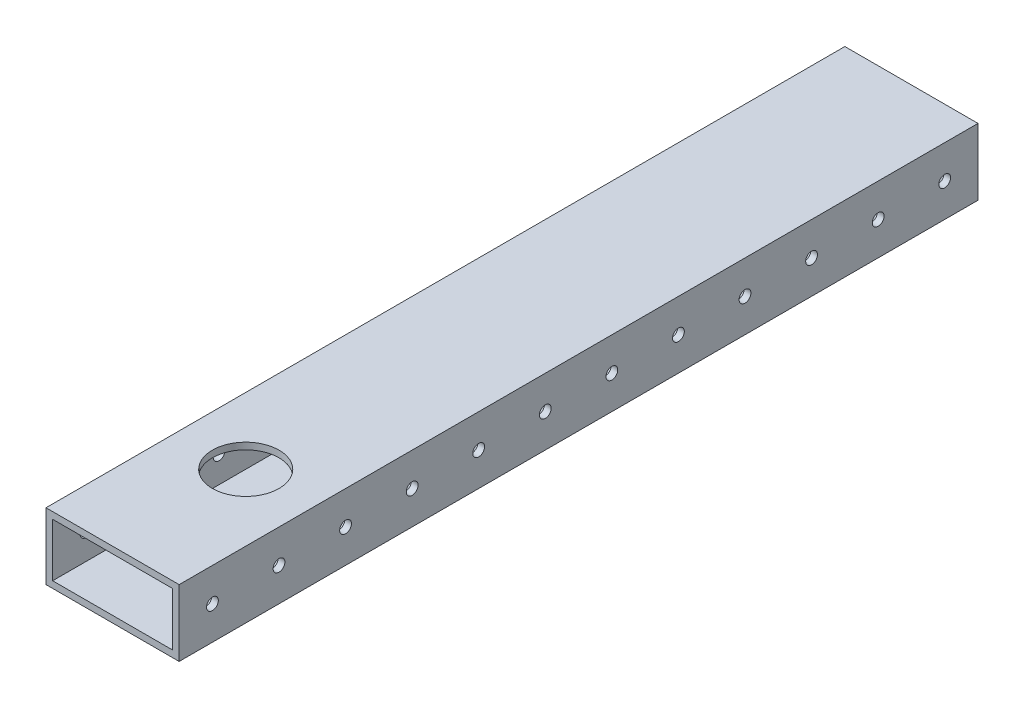
ISO-10303-21;
HEADER;
FILE_DESCRIPTION(('STEP AP214'),'2;1');
FILE_NAME('part.step','',(''),(''),'','','');
FILE_SCHEMA(('AUTOMOTIVE_DESIGN { 1 0 10303 214 1 1 1 1 }'));
ENDSEC;
DATA;
#1=APPLICATION_CONTEXT('core data for automotive mechanical design processes');
#2=APPLICATION_PROTOCOL_DEFINITION('international standard','automotive_design',2000,#1);
#3=PRODUCT_CONTEXT('',#1,'mechanical');
#4=PRODUCT('Part','Part','',(#3));
#5=PRODUCT_RELATED_PRODUCT_CATEGORY('part','',(#4));
#6=PRODUCT_DEFINITION_FORMATION('','',#4);
#7=PRODUCT_DEFINITION_CONTEXT('part definition',#1,'design');
#8=PRODUCT_DEFINITION('design','',#6,#7);
#9=PRODUCT_DEFINITION_SHAPE('','',#8);
#10=(LENGTH_UNIT() NAMED_UNIT(*) SI_UNIT(.MILLI.,.METRE.));
#11=(NAMED_UNIT(*) PLANE_ANGLE_UNIT() SI_UNIT($,.RADIAN.));
#12=(NAMED_UNIT(*) SI_UNIT($,.STERADIAN.) SOLID_ANGLE_UNIT());
#13=UNCERTAINTY_MEASURE_WITH_UNIT(LENGTH_MEASURE(1.E-05),#10,'distance_accuracy_value','');
#14=(GEOMETRIC_REPRESENTATION_CONTEXT(3) GLOBAL_UNCERTAINTY_ASSIGNED_CONTEXT((#13)) GLOBAL_UNIT_ASSIGNED_CONTEXT((#10,
#11,#12)) REPRESENTATION_CONTEXT('',''));
#15=CARTESIAN_POINT('',(0.,0.,0.));
#16=DIRECTION('',(0.,0.,1.));
#17=DIRECTION('',(1.,0.,0.));
#18=AXIS2_PLACEMENT_3D('',#15,#16,#17);
#19=CARTESIAN_POINT('',(25.4,-12.7,-355.6));
#20=DIRECTION('',(1.,0.,0.));
#21=DIRECTION('',(0.,0.,-1.));
#22=AXIS2_PLACEMENT_3D('',#19,#20,#21);
#23=PLANE('',#22);
#24=DIRECTION('',(0.,-1.,0.));
#25=VECTOR('',#24,1.);
#26=CARTESIAN_POINT('',(25.4,434.34,-50.8));
#27=LINE('',#26,#25);
#28=CARTESIAN_POINT('',(25.4,12.7,-50.8));
#29=VERTEX_POINT('',#28);
#30=CARTESIAN_POINT('',(25.4,-12.7,-50.8));
#31=VERTEX_POINT('',#30);
#32=EDGE_CURVE('E51',#29,#31,#27,.T.);
#33=ORIENTED_EDGE('',*,*,#32,.T.);
#34=DIRECTION('',(0.,0.,1.));
#35=VECTOR('',#34,1.);
#36=CARTESIAN_POINT('',(25.4,-12.7,-355.6));
#37=LINE('',#36,#35);
#38=CARTESIAN_POINT('',(25.4,-12.7,-355.6));
#39=VERTEX_POINT('',#38);
#40=EDGE_CURVE('E44',#39,#31,#37,.T.);
#41=ORIENTED_EDGE('',*,*,#40,.F.);
#42=DIRECTION('',(0.,1.,0.));
#43=VECTOR('',#42,1.);
#44=CARTESIAN_POINT('',(25.4,-12.7,-355.6));
#45=LINE('',#44,#43);
#46=CARTESIAN_POINT('',(25.4,12.7,-355.6));
#47=VERTEX_POINT('',#46);
#48=EDGE_CURVE('E305',#39,#47,#45,.T.);
#49=ORIENTED_EDGE('',*,*,#48,.T.);
#50=DIRECTION('',(0.,0.,1.));
#51=VECTOR('',#50,1.);
#52=CARTESIAN_POINT('',(25.4,12.7,-355.6));
#53=LINE('',#52,#51);
#54=EDGE_CURVE('E122',#47,#29,#53,.T.);
#55=ORIENTED_EDGE('',*,*,#54,.T.);
#56=EDGE_LOOP('',(#33,#41,#49,#55));
#57=FACE_BOUND('',#56,.T.);
#58=CARTESIAN_POINT('',(25.4,0.,-63.5));
#59=DIRECTION('',(1.,0.,0.));
#60=DIRECTION('',(0.,0.,-1.));
#61=AXIS2_PLACEMENT_3D('',#58,#59,#60);
#62=CIRCLE('',#61,2.24789999999999);
#63=CARTESIAN_POINT('',(25.4,0.,-65.7479));
#64=VERTEX_POINT('',#63);
#65=EDGE_CURVE('E190',#64,#64,#62,.T.);
#66=ORIENTED_EDGE('',*,*,#65,.F.);
#67=EDGE_LOOP('',(#66));
#68=FACE_BOUND('',#67,.T.);
#69=CARTESIAN_POINT('',(25.4,0.,-88.9));
#70=DIRECTION('',(1.,0.,0.));
#71=DIRECTION('',(0.,0.,-1.));
#72=AXIS2_PLACEMENT_3D('',#69,#70,#71);
#73=CIRCLE('',#72,2.24789999999999);
#74=CARTESIAN_POINT('',(25.4,0.,-91.1479));
#75=VERTEX_POINT('',#74);
#76=EDGE_CURVE('E207',#75,#75,#73,.T.);
#77=ORIENTED_EDGE('',*,*,#76,.F.);
#78=EDGE_LOOP('',(#77));
#79=FACE_BOUND('',#78,.T.);
#80=CARTESIAN_POINT('',(25.4,0.,-114.3));
#81=DIRECTION('',(1.,0.,0.));
#82=DIRECTION('',(0.,0.,-1.));
#83=AXIS2_PLACEMENT_3D('',#80,#81,#82);
#84=CIRCLE('',#83,2.24789999999999);
#85=CARTESIAN_POINT('',(25.4,0.,-116.5479));
#86=VERTEX_POINT('',#85);
#87=EDGE_CURVE('E214',#86,#86,#84,.T.);
#88=ORIENTED_EDGE('',*,*,#87,.F.);
#89=EDGE_LOOP('',(#88));
#90=FACE_BOUND('',#89,.T.);
#91=CARTESIAN_POINT('',(25.4,0.,-139.7));
#92=DIRECTION('',(1.,0.,0.));
#93=DIRECTION('',(0.,0.,-1.));
#94=AXIS2_PLACEMENT_3D('',#91,#92,#93);
#95=CIRCLE('',#94,2.24789999999999);
#96=CARTESIAN_POINT('',(25.4,0.,-141.9479));
#97=VERTEX_POINT('',#96);
#98=EDGE_CURVE('E221',#97,#97,#95,.T.);
#99=ORIENTED_EDGE('',*,*,#98,.F.);
#100=EDGE_LOOP('',(#99));
#101=FACE_BOUND('',#100,.T.);
#102=CARTESIAN_POINT('',(25.4,0.,-165.1));
#103=DIRECTION('',(1.,0.,0.));
#104=DIRECTION('',(0.,0.,-1.));
#105=AXIS2_PLACEMENT_3D('',#102,#103,#104);
#106=CIRCLE('',#105,2.24789999999999);
#107=CARTESIAN_POINT('',(25.4,0.,-167.3479));
#108=VERTEX_POINT('',#107);
#109=EDGE_CURVE('E228',#108,#108,#106,.T.);
#110=ORIENTED_EDGE('',*,*,#109,.F.);
#111=EDGE_LOOP('',(#110));
#112=FACE_BOUND('',#111,.T.);
#113=CARTESIAN_POINT('',(25.4,0.,-190.5));
#114=DIRECTION('',(1.,0.,0.));
#115=DIRECTION('',(0.,0.,-1.));
#116=AXIS2_PLACEMENT_3D('',#113,#114,#115);
#117=CIRCLE('',#116,2.24789999999999);
#118=CARTESIAN_POINT('',(25.4,0.,-192.7479));
#119=VERTEX_POINT('',#118);
#120=EDGE_CURVE('E235',#119,#119,#117,.T.);
#121=ORIENTED_EDGE('',*,*,#120,.F.);
#122=EDGE_LOOP('',(#121));
#123=FACE_BOUND('',#122,.T.);
#124=CARTESIAN_POINT('',(25.4,0.,-215.9));
#125=DIRECTION('',(1.,0.,0.));
#126=DIRECTION('',(0.,0.,-1.));
#127=AXIS2_PLACEMENT_3D('',#124,#125,#126);
#128=CIRCLE('',#127,2.24789999999999);
#129=CARTESIAN_POINT('',(25.4,0.,-218.1479));
#130=VERTEX_POINT('',#129);
#131=EDGE_CURVE('E242',#130,#130,#128,.T.);
#132=ORIENTED_EDGE('',*,*,#131,.F.);
#133=EDGE_LOOP('',(#132));
#134=FACE_BOUND('',#133,.T.);
#135=CARTESIAN_POINT('',(25.4,0.,-241.3));
#136=DIRECTION('',(1.,0.,0.));
#137=DIRECTION('',(0.,0.,-1.));
#138=AXIS2_PLACEMENT_3D('',#135,#136,#137);
#139=CIRCLE('',#138,2.24789999999999);
#140=CARTESIAN_POINT('',(25.4,0.,-243.5479));
#141=VERTEX_POINT('',#140);
#142=EDGE_CURVE('E249',#141,#141,#139,.T.);
#143=ORIENTED_EDGE('',*,*,#142,.F.);
#144=EDGE_LOOP('',(#143));
#145=FACE_BOUND('',#144,.T.);
#146=CARTESIAN_POINT('',(25.4,0.,-266.7));
#147=DIRECTION('',(1.,0.,0.));
#148=DIRECTION('',(0.,0.,-1.));
#149=AXIS2_PLACEMENT_3D('',#146,#147,#148);
#150=CIRCLE('',#149,2.24789999999999);
#151=CARTESIAN_POINT('',(25.4,0.,-268.9479));
#152=VERTEX_POINT('',#151);
#153=EDGE_CURVE('E256',#152,#152,#150,.T.);
#154=ORIENTED_EDGE('',*,*,#153,.F.);
#155=EDGE_LOOP('',(#154));
#156=FACE_BOUND('',#155,.T.);
#157=CARTESIAN_POINT('',(25.4,0.,-292.1));
#158=DIRECTION('',(1.,0.,0.));
#159=DIRECTION('',(0.,0.,-1.));
#160=AXIS2_PLACEMENT_3D('',#157,#158,#159);
#161=CIRCLE('',#160,2.24789999999999);
#162=CARTESIAN_POINT('',(25.4,0.,-294.3479));
#163=VERTEX_POINT('',#162);
#164=EDGE_CURVE('E263',#163,#163,#161,.T.);
#165=ORIENTED_EDGE('',*,*,#164,.F.);
#166=EDGE_LOOP('',(#165));
#167=FACE_BOUND('',#166,.T.);
#168=CARTESIAN_POINT('',(25.4,0.,-317.5));
#169=DIRECTION('',(1.,0.,0.));
#170=DIRECTION('',(0.,0.,-1.));
#171=AXIS2_PLACEMENT_3D('',#168,#169,#170);
#172=CIRCLE('',#171,2.24789999999999);
#173=CARTESIAN_POINT('',(25.4,0.,-319.7479));
#174=VERTEX_POINT('',#173);
#175=EDGE_CURVE('E270',#174,#174,#172,.T.);
#176=ORIENTED_EDGE('',*,*,#175,.F.);
#177=EDGE_LOOP('',(#176));
#178=FACE_BOUND('',#177,.T.);
#179=CARTESIAN_POINT('',(25.4,0.,-342.9));
#180=DIRECTION('',(1.,0.,0.));
#181=DIRECTION('',(0.,0.,-1.));
#182=AXIS2_PLACEMENT_3D('',#179,#180,#181);
#183=CIRCLE('',#182,2.24789999999999);
#184=CARTESIAN_POINT('',(25.4,0.,-345.1479));
#185=VERTEX_POINT('',#184);
#186=EDGE_CURVE('E282',#185,#185,#183,.T.);
#187=ORIENTED_EDGE('',*,*,#186,.F.);
#188=EDGE_LOOP('',(#187));
#189=FACE_BOUND('',#188,.T.);
#190=ADVANCED_FACE('F37',(#57,#68,#79,#90,#101,#112,#123,#134,#145,#156,#167,#178,#189),#23,.T.);
#191=CARTESIAN_POINT('',(-25.4,-12.7,-355.6));
#192=DIRECTION('',(0.,-1.,0.));
#193=DIRECTION('',(0.,0.,-1.));
#194=AXIS2_PLACEMENT_3D('',#191,#192,#193);
#195=PLANE('',#194);
#196=DIRECTION('',(1.,0.,0.));
#197=VECTOR('',#196,1.);
#198=CARTESIAN_POINT('',(-25.4,-12.7,-50.8));
#199=LINE('',#198,#197);
#200=CARTESIAN_POINT('',(-25.4,-12.7,-50.8));
#201=VERTEX_POINT('',#200);
#202=EDGE_CURVE('E105',#201,#31,#199,.T.);
#203=ORIENTED_EDGE('',*,*,#202,.F.);
#204=DIRECTION('',(0.,0.,1.));
#205=VECTOR('',#204,1.);
#206=CARTESIAN_POINT('',(-25.4,-12.7,-355.6));
#207=LINE('',#206,#205);
#208=CARTESIAN_POINT('',(-25.4,-12.7,-355.6));
#209=VERTEX_POINT('',#208);
#210=EDGE_CURVE('E115',#209,#201,#207,.T.);
#211=ORIENTED_EDGE('',*,*,#210,.F.);
#212=DIRECTION('',(1.,0.,0.));
#213=VECTOR('',#212,1.);
#214=CARTESIAN_POINT('',(-25.4,-12.7,-355.6));
#215=LINE('',#214,#213);
#216=EDGE_CURVE('E125',#209,#39,#215,.T.);
#217=ORIENTED_EDGE('',*,*,#216,.T.);
#218=ORIENTED_EDGE('',*,*,#40,.T.);
#219=EDGE_LOOP('',(#203,#211,#217,#218));
#220=FACE_BOUND('',#219,.T.);
#221=CARTESIAN_POINT('',(0.,-12.7,-101.6));
#222=DIRECTION('',(0.,1.,0.));
#223=DIRECTION('',(0.,0.,1.));
#224=AXIS2_PLACEMENT_3D('',#221,#222,#223);
#225=CIRCLE('',#224,12.7);
#226=CARTESIAN_POINT('',(0.,-12.7,-88.9));
#227=VERTEX_POINT('',#226);
#228=EDGE_CURVE('E186',#227,#227,#225,.T.);
#229=ORIENTED_EDGE('',*,*,#228,.T.);
#230=EDGE_LOOP('',(#229));
#231=FACE_BOUND('',#230,.T.);
#232=ADVANCED_FACE('F322',(#220,#231),#195,.T.);
#233=CARTESIAN_POINT('',(-25.4,-12.7,-355.6));
#234=DIRECTION('',(-1.,0.,0.));
#235=DIRECTION('',(0.,0.,1.));
#236=AXIS2_PLACEMENT_3D('',#233,#234,#235);
#237=PLANE('',#236);
#238=DIRECTION('',(0.,-1.,0.));
#239=VECTOR('',#238,1.);
#240=CARTESIAN_POINT('',(-25.4,434.34,-50.8));
#241=LINE('',#240,#239);
#242=CARTESIAN_POINT('',(-25.4,12.7,-50.8));
#243=VERTEX_POINT('',#242);
#244=EDGE_CURVE('E100',#243,#201,#241,.T.);
#245=ORIENTED_EDGE('',*,*,#244,.F.);
#246=DIRECTION('',(0.,0.,1.));
#247=VECTOR('',#246,1.);
#248=CARTESIAN_POINT('',(-25.4,12.7,-355.6));
#249=LINE('',#248,#247);
#250=CARTESIAN_POINT('',(-25.4,12.7,-355.6));
#251=VERTEX_POINT('',#250);
#252=EDGE_CURVE('E113',#251,#243,#249,.T.);
#253=ORIENTED_EDGE('',*,*,#252,.F.);
#254=DIRECTION('',(0.,-1.,0.));
#255=VECTOR('',#254,1.);
#256=CARTESIAN_POINT('',(-25.4,-12.7,-355.6));
#257=LINE('',#256,#255);
#258=EDGE_CURVE('E317',#251,#209,#257,.T.);
#259=ORIENTED_EDGE('',*,*,#258,.T.);
#260=ORIENTED_EDGE('',*,*,#210,.T.);
#261=EDGE_LOOP('',(#245,#253,#259,#260));
#262=FACE_BOUND('',#261,.T.);
#263=CARTESIAN_POINT('',(-25.4,0.,-63.5));
#264=DIRECTION('',(1.,0.,0.));
#265=DIRECTION('',(0.,0.,-1.));
#266=AXIS2_PLACEMENT_3D('',#263,#264,#265);
#267=CIRCLE('',#266,2.24789999999999);
#268=CARTESIAN_POINT('',(-25.4,0.,-65.7479));
#269=VERTEX_POINT('',#268);
#270=EDGE_CURVE('E182',#269,#269,#267,.T.);
#271=ORIENTED_EDGE('',*,*,#270,.T.);
#272=EDGE_LOOP('',(#271));
#273=FACE_BOUND('',#272,.T.);
#274=CARTESIAN_POINT('',(-25.4,0.,-88.9));
#275=DIRECTION('',(1.,0.,0.));
#276=DIRECTION('',(0.,0.,-1.));
#277=AXIS2_PLACEMENT_3D('',#274,#275,#276);
#278=CIRCLE('',#277,2.24789999999999);
#279=CARTESIAN_POINT('',(-25.4,0.,-91.1479));
#280=VERTEX_POINT('',#279);
#281=EDGE_CURVE('E178',#280,#280,#278,.T.);
#282=ORIENTED_EDGE('',*,*,#281,.T.);
#283=EDGE_LOOP('',(#282));
#284=FACE_BOUND('',#283,.T.);
#285=CARTESIAN_POINT('',(-25.4,0.,-114.3));
#286=DIRECTION('',(1.,0.,0.));
#287=DIRECTION('',(0.,0.,-1.));
#288=AXIS2_PLACEMENT_3D('',#285,#286,#287);
#289=CIRCLE('',#288,2.24789999999999);
#290=CARTESIAN_POINT('',(-25.4,0.,-116.5479));
#291=VERTEX_POINT('',#290);
#292=EDGE_CURVE('E173',#291,#291,#289,.T.);
#293=ORIENTED_EDGE('',*,*,#292,.T.);
#294=EDGE_LOOP('',(#293));
#295=FACE_BOUND('',#294,.T.);
#296=CARTESIAN_POINT('',(-25.4,0.,-139.7));
#297=DIRECTION('',(1.,0.,0.));
#298=DIRECTION('',(0.,0.,-1.));
#299=AXIS2_PLACEMENT_3D('',#296,#297,#298);
#300=CIRCLE('',#299,2.24789999999999);
#301=CARTESIAN_POINT('',(-25.4,0.,-141.9479));
#302=VERTEX_POINT('',#301);
#303=EDGE_CURVE('E168',#302,#302,#300,.T.);
#304=ORIENTED_EDGE('',*,*,#303,.T.);
#305=EDGE_LOOP('',(#304));
#306=FACE_BOUND('',#305,.T.);
#307=CARTESIAN_POINT('',(-25.4,0.,-165.1));
#308=DIRECTION('',(1.,0.,0.));
#309=DIRECTION('',(0.,0.,-1.));
#310=AXIS2_PLACEMENT_3D('',#307,#308,#309);
#311=CIRCLE('',#310,2.24789999999999);
#312=CARTESIAN_POINT('',(-25.4,0.,-167.3479));
#313=VERTEX_POINT('',#312);
#314=EDGE_CURVE('E163',#313,#313,#311,.T.);
#315=ORIENTED_EDGE('',*,*,#314,.T.);
#316=EDGE_LOOP('',(#315));
#317=FACE_BOUND('',#316,.T.);
#318=CARTESIAN_POINT('',(-25.4,0.,-190.5));
#319=DIRECTION('',(1.,0.,0.));
#320=DIRECTION('',(0.,0.,-1.));
#321=AXIS2_PLACEMENT_3D('',#318,#319,#320);
#322=CIRCLE('',#321,2.24789999999999);
#323=CARTESIAN_POINT('',(-25.4,0.,-192.7479));
#324=VERTEX_POINT('',#323);
#325=EDGE_CURVE('E158',#324,#324,#322,.T.);
#326=ORIENTED_EDGE('',*,*,#325,.T.);
#327=EDGE_LOOP('',(#326));
#328=FACE_BOUND('',#327,.T.);
#329=CARTESIAN_POINT('',(-25.4,0.,-215.9));
#330=DIRECTION('',(1.,0.,0.));
#331=DIRECTION('',(0.,0.,-1.));
#332=AXIS2_PLACEMENT_3D('',#329,#330,#331);
#333=CIRCLE('',#332,2.24789999999999);
#334=CARTESIAN_POINT('',(-25.4,0.,-218.1479));
#335=VERTEX_POINT('',#334);
#336=EDGE_CURVE('E153',#335,#335,#333,.T.);
#337=ORIENTED_EDGE('',*,*,#336,.T.);
#338=EDGE_LOOP('',(#337));
#339=FACE_BOUND('',#338,.T.);
#340=CARTESIAN_POINT('',(-25.4,0.,-241.3));
#341=DIRECTION('',(1.,0.,0.));
#342=DIRECTION('',(0.,0.,-1.));
#343=AXIS2_PLACEMENT_3D('',#340,#341,#342);
#344=CIRCLE('',#343,2.24789999999999);
#345=CARTESIAN_POINT('',(-25.4,0.,-243.5479));
#346=VERTEX_POINT('',#345);
#347=EDGE_CURVE('E148',#346,#346,#344,.T.);
#348=ORIENTED_EDGE('',*,*,#347,.T.);
#349=EDGE_LOOP('',(#348));
#350=FACE_BOUND('',#349,.T.);
#351=CARTESIAN_POINT('',(-25.4,0.,-266.7));
#352=DIRECTION('',(1.,0.,0.));
#353=DIRECTION('',(0.,0.,-1.));
#354=AXIS2_PLACEMENT_3D('',#351,#352,#353);
#355=CIRCLE('',#354,2.24789999999999);
#356=CARTESIAN_POINT('',(-25.4,0.,-268.9479));
#357=VERTEX_POINT('',#356);
#358=EDGE_CURVE('E143',#357,#357,#355,.T.);
#359=ORIENTED_EDGE('',*,*,#358,.T.);
#360=EDGE_LOOP('',(#359));
#361=FACE_BOUND('',#360,.T.);
#362=CARTESIAN_POINT('',(-25.4,0.,-292.1));
#363=DIRECTION('',(1.,0.,0.));
#364=DIRECTION('',(0.,0.,-1.));
#365=AXIS2_PLACEMENT_3D('',#362,#363,#364);
#366=CIRCLE('',#365,2.24789999999999);
#367=CARTESIAN_POINT('',(-25.4,0.,-294.3479));
#368=VERTEX_POINT('',#367);
#369=EDGE_CURVE('E138',#368,#368,#366,.T.);
#370=ORIENTED_EDGE('',*,*,#369,.T.);
#371=EDGE_LOOP('',(#370));
#372=FACE_BOUND('',#371,.T.);
#373=CARTESIAN_POINT('',(-25.4,0.,-317.5));
#374=DIRECTION('',(1.,0.,0.));
#375=DIRECTION('',(0.,0.,-1.));
#376=AXIS2_PLACEMENT_3D('',#373,#374,#375);
#377=CIRCLE('',#376,2.24789999999999);
#378=CARTESIAN_POINT('',(-25.4,0.,-319.7479));
#379=VERTEX_POINT('',#378);
#380=EDGE_CURVE('E273',#379,#379,#377,.T.);
#381=ORIENTED_EDGE('',*,*,#380,.T.);
#382=EDGE_LOOP('',(#381));
#383=FACE_BOUND('',#382,.T.);
#384=CARTESIAN_POINT('',(-25.4,0.,-342.9));
#385=DIRECTION('',(1.,0.,0.));
#386=DIRECTION('',(0.,0.,-1.));
#387=AXIS2_PLACEMENT_3D('',#384,#385,#386);
#388=CIRCLE('',#387,2.24789999999999);
#389=CARTESIAN_POINT('',(-25.4,0.,-345.1479));
#390=VERTEX_POINT('',#389);
#391=EDGE_CURVE('E133',#390,#390,#388,.T.);
#392=ORIENTED_EDGE('',*,*,#391,.T.);
#393=EDGE_LOOP('',(#392));
#394=FACE_BOUND('',#393,.T.);
#395=ADVANCED_FACE('F110',(#262,#273,#284,#295,#306,#317,#328,#339,#350,#361,#372,#383,#394),
#237,.T.);
#396=CARTESIAN_POINT('',(-25.4,12.7,-355.6));
#397=DIRECTION('',(0.,1.,0.));
#398=DIRECTION('',(0.,0.,1.));
#399=AXIS2_PLACEMENT_3D('',#396,#397,#398);
#400=PLANE('',#399);
#401=DIRECTION('',(-1.,0.,0.));
#402=VECTOR('',#401,1.);
#403=CARTESIAN_POINT('',(-25.4,12.7,-50.8));
#404=LINE('',#403,#402);
#405=EDGE_CURVE('E97',#29,#243,#404,.T.);
#406=ORIENTED_EDGE('',*,*,#405,.F.);
#407=ORIENTED_EDGE('',*,*,#54,.F.);
#408=DIRECTION('',(-1.,0.,0.));
#409=VECTOR('',#408,1.);
#410=CARTESIAN_POINT('',(-25.4,12.7,-355.6));
#411=LINE('',#410,#409);
#412=EDGE_CURVE('E121',#47,#251,#411,.T.);
#413=ORIENTED_EDGE('',*,*,#412,.T.);
#414=ORIENTED_EDGE('',*,*,#252,.T.);
#415=EDGE_LOOP('',(#406,#407,#413,#414));
#416=FACE_BOUND('',#415,.T.);
#417=CARTESIAN_POINT('',(0.,12.7,-101.6));
#418=DIRECTION('',(0.,1.,0.));
#419=DIRECTION('',(0.,0.,1.));
#420=AXIS2_PLACEMENT_3D('',#417,#418,#419);
#421=CIRCLE('',#420,12.7);
#422=CARTESIAN_POINT('',(0.,12.7,-88.9));
#423=VERTEX_POINT('',#422);
#424=EDGE_CURVE('E193',#423,#423,#421,.T.);
#425=ORIENTED_EDGE('',*,*,#424,.F.);
#426=EDGE_LOOP('',(#425));
#427=FACE_BOUND('',#426,.T.);
#428=ADVANCED_FACE('F118',(#416,#427),#400,.T.);
#429=CARTESIAN_POINT('',(0.,0.,-355.6));
#430=DIRECTION('',(0.,0.,-1.));
#431=DIRECTION('',(-1.,0.,0.));
#432=AXIS2_PLACEMENT_3D('',#429,#430,#431);
#433=PLANE('',#432);
#434=DIRECTION('',(0.,1.,0.));
#435=VECTOR('',#434,1.);
#436=CARTESIAN_POINT('',(22.86,-10.16,-355.6));
#437=LINE('',#436,#435);
#438=CARTESIAN_POINT('',(22.86,-10.16,-355.6));
#439=VERTEX_POINT('',#438);
#440=CARTESIAN_POINT('',(22.86,10.16,-355.6));
#441=VERTEX_POINT('',#440);
#442=EDGE_CURVE('E289',#439,#441,#437,.T.);
#443=ORIENTED_EDGE('',*,*,#442,.T.);
#444=DIRECTION('',(-1.,0.,0.));
#445=VECTOR('',#444,1.);
#446=CARTESIAN_POINT('',(-22.86,10.16,-355.6));
#447=LINE('',#446,#445);
#448=CARTESIAN_POINT('',(-22.86,10.16,-355.6));
#449=VERTEX_POINT('',#448);
#450=EDGE_CURVE('E292',#441,#449,#447,.T.);
#451=ORIENTED_EDGE('',*,*,#450,.T.);
#452=DIRECTION('',(0.,-1.,0.));
#453=VECTOR('',#452,1.);
#454=CARTESIAN_POINT('',(-22.86,-10.16,-355.6));
#455=LINE('',#454,#453);
#456=CARTESIAN_POINT('',(-22.86,-10.16,-355.6));
#457=VERTEX_POINT('',#456);
#458=EDGE_CURVE('E295',#449,#457,#455,.T.);
#459=ORIENTED_EDGE('',*,*,#458,.T.);
#460=DIRECTION('',(1.,0.,0.));
#461=VECTOR('',#460,1.);
#462=CARTESIAN_POINT('',(-22.86,-10.16,-355.6));
#463=LINE('',#462,#461);
#464=EDGE_CURVE('E298',#457,#439,#463,.T.);
#465=ORIENTED_EDGE('',*,*,#464,.T.);
#466=EDGE_LOOP('',(#443,#451,#459,#465));
#467=FACE_BOUND('',#466,.T.);
#468=ORIENTED_EDGE('',*,*,#48,.F.);
#469=ORIENTED_EDGE('',*,*,#216,.F.);
#470=ORIENTED_EDGE('',*,*,#258,.F.);
#471=ORIENTED_EDGE('',*,*,#412,.F.);
#472=EDGE_LOOP('',(#468,#469,#470,#471));
#473=FACE_BOUND('',#472,.T.);
#474=ADVANCED_FACE('F328',(#467,#473),#433,.T.);
#475=CARTESIAN_POINT('',(22.86,-10.16,-355.6));
#476=DIRECTION('',(1.,0.,0.));
#477=DIRECTION('',(0.,0.,-1.));
#478=AXIS2_PLACEMENT_3D('',#475,#476,#477);
#479=PLANE('',#478);
#480=CARTESIAN_POINT('',(22.86,0.,-63.5));
#481=DIRECTION('',(1.,0.,0.));
#482=DIRECTION('',(0.,0.,-1.));
#483=AXIS2_PLACEMENT_3D('',#480,#481,#482);
#484=CIRCLE('',#483,2.24789999999999);
#485=CARTESIAN_POINT('',(22.86,0.,-65.7479));
#486=VERTEX_POINT('',#485);
#487=EDGE_CURVE('E181',#486,#486,#484,.T.);
#488=ORIENTED_EDGE('',*,*,#487,.T.);
#489=EDGE_LOOP('',(#488));
#490=FACE_BOUND('',#489,.T.);
#491=CARTESIAN_POINT('',(22.86,0.,-88.9));
#492=DIRECTION('',(1.,0.,0.));
#493=DIRECTION('',(0.,0.,-1.));
#494=AXIS2_PLACEMENT_3D('',#491,#492,#493);
#495=CIRCLE('',#494,2.24789999999999);
#496=CARTESIAN_POINT('',(22.86,0.,-91.1479));
#497=VERTEX_POINT('',#496);
#498=EDGE_CURVE('E174',#497,#497,#495,.T.);
#499=ORIENTED_EDGE('',*,*,#498,.T.);
#500=EDGE_LOOP('',(#499));
#501=FACE_BOUND('',#500,.T.);
#502=CARTESIAN_POINT('',(22.86,0.,-114.3));
#503=DIRECTION('',(1.,0.,0.));
#504=DIRECTION('',(0.,0.,-1.));
#505=AXIS2_PLACEMENT_3D('',#502,#503,#504);
#506=CIRCLE('',#505,2.24789999999999);
#507=CARTESIAN_POINT('',(22.86,0.,-116.5479));
#508=VERTEX_POINT('',#507);
#509=EDGE_CURVE('E169',#508,#508,#506,.T.);
#510=ORIENTED_EDGE('',*,*,#509,.T.);
#511=EDGE_LOOP('',(#510));
#512=FACE_BOUND('',#511,.T.);
#513=CARTESIAN_POINT('',(22.86,0.,-139.7));
#514=DIRECTION('',(1.,0.,0.));
#515=DIRECTION('',(0.,0.,-1.));
#516=AXIS2_PLACEMENT_3D('',#513,#514,#515);
#517=CIRCLE('',#516,2.24789999999999);
#518=CARTESIAN_POINT('',(22.86,0.,-141.9479));
#519=VERTEX_POINT('',#518);
#520=EDGE_CURVE('E167',#519,#519,#517,.T.);
#521=ORIENTED_EDGE('',*,*,#520,.T.);
#522=EDGE_LOOP('',(#521));
#523=FACE_BOUND('',#522,.T.);
#524=CARTESIAN_POINT('',(22.86,0.,-165.1));
#525=DIRECTION('',(1.,0.,0.));
#526=DIRECTION('',(0.,0.,-1.));
#527=AXIS2_PLACEMENT_3D('',#524,#525,#526);
#528=CIRCLE('',#527,2.24789999999999);
#529=CARTESIAN_POINT('',(22.86,0.,-167.3479));
#530=VERTEX_POINT('',#529);
#531=EDGE_CURVE('E162',#530,#530,#528,.T.);
#532=ORIENTED_EDGE('',*,*,#531,.T.);
#533=EDGE_LOOP('',(#532));
#534=FACE_BOUND('',#533,.T.);
#535=CARTESIAN_POINT('',(22.86,0.,-190.5));
#536=DIRECTION('',(1.,0.,0.));
#537=DIRECTION('',(0.,0.,-1.));
#538=AXIS2_PLACEMENT_3D('',#535,#536,#537);
#539=CIRCLE('',#538,2.24789999999999);
#540=CARTESIAN_POINT('',(22.86,0.,-192.7479));
#541=VERTEX_POINT('',#540);
#542=EDGE_CURVE('E157',#541,#541,#539,.T.);
#543=ORIENTED_EDGE('',*,*,#542,.T.);
#544=EDGE_LOOP('',(#543));
#545=FACE_BOUND('',#544,.T.);
#546=CARTESIAN_POINT('',(22.86,0.,-215.9));
#547=DIRECTION('',(1.,0.,0.));
#548=DIRECTION('',(0.,0.,-1.));
#549=AXIS2_PLACEMENT_3D('',#546,#547,#548);
#550=CIRCLE('',#549,2.24789999999999);
#551=CARTESIAN_POINT('',(22.86,0.,-218.1479));
#552=VERTEX_POINT('',#551);
#553=EDGE_CURVE('E152',#552,#552,#550,.T.);
#554=ORIENTED_EDGE('',*,*,#553,.T.);
#555=EDGE_LOOP('',(#554));
#556=FACE_BOUND('',#555,.T.);
#557=CARTESIAN_POINT('',(22.86,0.,-241.3));
#558=DIRECTION('',(1.,0.,0.));
#559=DIRECTION('',(0.,0.,-1.));
#560=AXIS2_PLACEMENT_3D('',#557,#558,#559);
#561=CIRCLE('',#560,2.24789999999999);
#562=CARTESIAN_POINT('',(22.86,0.,-243.5479));
#563=VERTEX_POINT('',#562);
#564=EDGE_CURVE('E147',#563,#563,#561,.T.);
#565=ORIENTED_EDGE('',*,*,#564,.T.);
#566=EDGE_LOOP('',(#565));
#567=FACE_BOUND('',#566,.T.);
#568=CARTESIAN_POINT('',(22.86,0.,-266.7));
#569=DIRECTION('',(1.,0.,0.));
#570=DIRECTION('',(0.,0.,-1.));
#571=AXIS2_PLACEMENT_3D('',#568,#569,#570);
#572=CIRCLE('',#571,2.24789999999999);
#573=CARTESIAN_POINT('',(22.86,0.,-268.9479));
#574=VERTEX_POINT('',#573);
#575=EDGE_CURVE('E142',#574,#574,#572,.T.);
#576=ORIENTED_EDGE('',*,*,#575,.T.);
#577=EDGE_LOOP('',(#576));
#578=FACE_BOUND('',#577,.T.);
#579=CARTESIAN_POINT('',(22.86,0.,-292.1));
#580=DIRECTION('',(1.,0.,0.));
#581=DIRECTION('',(0.,0.,-1.));
#582=AXIS2_PLACEMENT_3D('',#579,#580,#581);
#583=CIRCLE('',#582,2.24789999999999);
#584=CARTESIAN_POINT('',(22.86,0.,-294.3479));
#585=VERTEX_POINT('',#584);
#586=EDGE_CURVE('E137',#585,#585,#583,.T.);
#587=ORIENTED_EDGE('',*,*,#586,.T.);
#588=EDGE_LOOP('',(#587));
#589=FACE_BOUND('',#588,.T.);
#590=CARTESIAN_POINT('',(22.86,0.,-317.5));
#591=DIRECTION('',(1.,0.,0.));
#592=DIRECTION('',(0.,0.,-1.));
#593=AXIS2_PLACEMENT_3D('',#590,#591,#592);
#594=CIRCLE('',#593,2.24789999999999);
#595=CARTESIAN_POINT('',(22.86,0.,-319.7479));
#596=VERTEX_POINT('',#595);
#597=EDGE_CURVE('E276',#596,#596,#594,.T.);
#598=ORIENTED_EDGE('',*,*,#597,.T.);
#599=EDGE_LOOP('',(#598));
#600=FACE_BOUND('',#599,.T.);
#601=CARTESIAN_POINT('',(22.86,0.,-342.9));
#602=DIRECTION('',(1.,0.,0.));
#603=DIRECTION('',(0.,0.,-1.));
#604=AXIS2_PLACEMENT_3D('',#601,#602,#603);
#605=CIRCLE('',#604,2.24789999999999);
#606=CARTESIAN_POINT('',(22.86,0.,-345.1479));
#607=VERTEX_POINT('',#606);
#608=EDGE_CURVE('E129',#607,#607,#605,.T.);
#609=ORIENTED_EDGE('',*,*,#608,.T.);
#610=EDGE_LOOP('',(#609));
#611=FACE_BOUND('',#610,.T.);
#612=DIRECTION('',(0.,0.,1.));
#613=VECTOR('',#612,1.);
#614=CARTESIAN_POINT('',(22.86,-10.16,-355.6));
#615=LINE('',#614,#613);
#616=CARTESIAN_POINT('',(22.86,-10.16,-50.8));
#617=VERTEX_POINT('',#616);
#618=EDGE_CURVE('E302',#439,#617,#615,.T.);
#619=ORIENTED_EDGE('',*,*,#618,.T.);
#620=DIRECTION('',(0.,1.,0.));
#621=VECTOR('',#620,1.);
#622=CARTESIAN_POINT('',(22.86,-10.16,-50.8));
#623=LINE('',#622,#621);
#624=CARTESIAN_POINT('',(22.86,10.16,-50.8));
#625=VERTEX_POINT('',#624);
#626=EDGE_CURVE('E106',#617,#625,#623,.T.);
#627=ORIENTED_EDGE('',*,*,#626,.T.);
#628=DIRECTION('',(0.,0.,1.));
#629=VECTOR('',#628,1.);
#630=CARTESIAN_POINT('',(22.86,10.16,-355.6));
#631=LINE('',#630,#629);
#632=EDGE_CURVE('E301',#441,#625,#631,.T.);
#633=ORIENTED_EDGE('',*,*,#632,.F.);
#634=ORIENTED_EDGE('',*,*,#442,.F.);
#635=EDGE_LOOP('',(#619,#627,#633,#634));
#636=FACE_BOUND('',#635,.T.);
#637=ADVANCED_FACE('F330',(#490,#501,#512,#523,#534,#545,#556,#567,#578,#589,#600,#611,#636),
#479,.F.);
#638=CARTESIAN_POINT('',(-22.86,-10.16,-355.6));
#639=DIRECTION('',(0.,-1.,0.));
#640=DIRECTION('',(0.,0.,-1.));
#641=AXIS2_PLACEMENT_3D('',#638,#639,#640);
#642=PLANE('',#641);
#643=CARTESIAN_POINT('',(0.,-10.16,-101.6));
#644=DIRECTION('',(0.,-1.,0.));
#645=DIRECTION('',(0.,0.,-1.));
#646=AXIS2_PLACEMENT_3D('',#643,#644,#645);
#647=CIRCLE('',#646,12.7);
#648=CARTESIAN_POINT('',(0.,-10.16,-114.3));
#649=VERTEX_POINT('',#648);
#650=EDGE_CURVE('E183',#649,#649,#647,.T.);
#651=ORIENTED_EDGE('',*,*,#650,.T.);
#652=EDGE_LOOP('',(#651));
#653=FACE_BOUND('',#652,.T.);
#654=DIRECTION('',(0.,0.,1.));
#655=VECTOR('',#654,1.);
#656=CARTESIAN_POINT('',(-22.86,-10.16,-355.6));
#657=LINE('',#656,#655);
#658=CARTESIAN_POINT('',(-22.86,-10.16,-50.8));
#659=VERTEX_POINT('',#658);
#660=EDGE_CURVE('E306',#457,#659,#657,.T.);
#661=ORIENTED_EDGE('',*,*,#660,.T.);
#662=DIRECTION('',(1.,0.,0.));
#663=VECTOR('',#662,1.);
#664=CARTESIAN_POINT('',(-22.86,-10.16,-50.8));
#665=LINE('',#664,#663);
#666=EDGE_CURVE('E672',#659,#617,#665,.T.);
#667=ORIENTED_EDGE('',*,*,#666,.T.);
#668=ORIENTED_EDGE('',*,*,#618,.F.);
#669=ORIENTED_EDGE('',*,*,#464,.F.);
#670=EDGE_LOOP('',(#661,#667,#668,#669));
#671=FACE_BOUND('',#670,.T.);
#672=ADVANCED_FACE('F338',(#653,#671),#642,.F.);
#673=CARTESIAN_POINT('',(-22.86,-10.16,-355.6));
#674=DIRECTION('',(-1.,0.,0.));
#675=DIRECTION('',(0.,0.,1.));
#676=AXIS2_PLACEMENT_3D('',#673,#674,#675);
#677=PLANE('',#676);
#678=CARTESIAN_POINT('',(-22.86,0.,-63.5));
#679=DIRECTION('',(-1.,0.,0.));
#680=DIRECTION('',(0.,0.,1.));
#681=AXIS2_PLACEMENT_3D('',#678,#679,#680);
#682=CIRCLE('',#681,2.24789999999999);
#683=CARTESIAN_POINT('',(-22.86,0.,-61.2521));
#684=VERTEX_POINT('',#683);
#685=EDGE_CURVE('E179',#684,#684,#682,.T.);
#686=ORIENTED_EDGE('',*,*,#685,.T.);
#687=EDGE_LOOP('',(#686));
#688=FACE_BOUND('',#687,.T.);
#689=CARTESIAN_POINT('',(-22.86,0.,-88.9));
#690=DIRECTION('',(-1.,0.,0.));
#691=DIRECTION('',(0.,0.,1.));
#692=AXIS2_PLACEMENT_3D('',#689,#690,#691);
#693=CIRCLE('',#692,2.24789999999999);
#694=CARTESIAN_POINT('',(-22.86,0.,-86.6521));
#695=VERTEX_POINT('',#694);
#696=EDGE_CURVE('E177',#695,#695,#693,.T.);
#697=ORIENTED_EDGE('',*,*,#696,.T.);
#698=EDGE_LOOP('',(#697));
#699=FACE_BOUND('',#698,.T.);
#700=CARTESIAN_POINT('',(-22.86,0.,-114.3));
#701=DIRECTION('',(-1.,0.,0.));
#702=DIRECTION('',(0.,0.,1.));
#703=AXIS2_PLACEMENT_3D('',#700,#701,#702);
#704=CIRCLE('',#703,2.24789999999999);
#705=CARTESIAN_POINT('',(-22.86,0.,-112.0521));
#706=VERTEX_POINT('',#705);
#707=EDGE_CURVE('E172',#706,#706,#704,.T.);
#708=ORIENTED_EDGE('',*,*,#707,.T.);
#709=EDGE_LOOP('',(#708));
#710=FACE_BOUND('',#709,.T.);
#711=CARTESIAN_POINT('',(-22.86,0.,-139.7));
#712=DIRECTION('',(-1.,0.,0.));
#713=DIRECTION('',(0.,0.,1.));
#714=AXIS2_PLACEMENT_3D('',#711,#712,#713);
#715=CIRCLE('',#714,2.24789999999999);
#716=CARTESIAN_POINT('',(-22.86,0.,-137.4521));
#717=VERTEX_POINT('',#716);
#718=EDGE_CURVE('E164',#717,#717,#715,.T.);
#719=ORIENTED_EDGE('',*,*,#718,.T.);
#720=EDGE_LOOP('',(#719));
#721=FACE_BOUND('',#720,.T.);
#722=CARTESIAN_POINT('',(-22.86,0.,-165.1));
#723=DIRECTION('',(-1.,0.,0.));
#724=DIRECTION('',(0.,0.,1.));
#725=AXIS2_PLACEMENT_3D('',#722,#723,#724);
#726=CIRCLE('',#725,2.24789999999999);
#727=CARTESIAN_POINT('',(-22.86,0.,-162.8521));
#728=VERTEX_POINT('',#727);
#729=EDGE_CURVE('E159',#728,#728,#726,.T.);
#730=ORIENTED_EDGE('',*,*,#729,.T.);
#731=EDGE_LOOP('',(#730));
#732=FACE_BOUND('',#731,.T.);
#733=CARTESIAN_POINT('',(-22.86,0.,-190.5));
#734=DIRECTION('',(-1.,0.,0.));
#735=DIRECTION('',(0.,0.,1.));
#736=AXIS2_PLACEMENT_3D('',#733,#734,#735);
#737=CIRCLE('',#736,2.24789999999999);
#738=CARTESIAN_POINT('',(-22.86,0.,-188.2521));
#739=VERTEX_POINT('',#738);
#740=EDGE_CURVE('E154',#739,#739,#737,.T.);
#741=ORIENTED_EDGE('',*,*,#740,.T.);
#742=EDGE_LOOP('',(#741));
#743=FACE_BOUND('',#742,.T.);
#744=CARTESIAN_POINT('',(-22.86,0.,-215.9));
#745=DIRECTION('',(-1.,0.,0.));
#746=DIRECTION('',(0.,0.,1.));
#747=AXIS2_PLACEMENT_3D('',#744,#745,#746);
#748=CIRCLE('',#747,2.24789999999999);
#749=CARTESIAN_POINT('',(-22.86,0.,-213.6521));
#750=VERTEX_POINT('',#749);
#751=EDGE_CURVE('E149',#750,#750,#748,.T.);
#752=ORIENTED_EDGE('',*,*,#751,.T.);
#753=EDGE_LOOP('',(#752));
#754=FACE_BOUND('',#753,.T.);
#755=CARTESIAN_POINT('',(-22.86,0.,-241.3));
#756=DIRECTION('',(-1.,0.,0.));
#757=DIRECTION('',(0.,0.,1.));
#758=AXIS2_PLACEMENT_3D('',#755,#756,#757);
#759=CIRCLE('',#758,2.24789999999999);
#760=CARTESIAN_POINT('',(-22.86,0.,-239.0521));
#761=VERTEX_POINT('',#760);
#762=EDGE_CURVE('E144',#761,#761,#759,.T.);
#763=ORIENTED_EDGE('',*,*,#762,.T.);
#764=EDGE_LOOP('',(#763));
#765=FACE_BOUND('',#764,.T.);
#766=CARTESIAN_POINT('',(-22.86,0.,-266.7));
#767=DIRECTION('',(-1.,0.,0.));
#768=DIRECTION('',(0.,0.,1.));
#769=AXIS2_PLACEMENT_3D('',#766,#767,#768);
#770=CIRCLE('',#769,2.24789999999999);
#771=CARTESIAN_POINT('',(-22.86,0.,-264.4521));
#772=VERTEX_POINT('',#771);
#773=EDGE_CURVE('E139',#772,#772,#770,.T.);
#774=ORIENTED_EDGE('',*,*,#773,.T.);
#775=EDGE_LOOP('',(#774));
#776=FACE_BOUND('',#775,.T.);
#777=CARTESIAN_POINT('',(-22.86,0.,-292.1));
#778=DIRECTION('',(-1.,0.,0.));
#779=DIRECTION('',(0.,0.,1.));
#780=AXIS2_PLACEMENT_3D('',#777,#778,#779);
#781=CIRCLE('',#780,2.24789999999999);
#782=CARTESIAN_POINT('',(-22.86,0.,-289.8521));
#783=VERTEX_POINT('',#782);
#784=EDGE_CURVE('E134',#783,#783,#781,.T.);
#785=ORIENTED_EDGE('',*,*,#784,.T.);
#786=EDGE_LOOP('',(#785));
#787=FACE_BOUND('',#786,.T.);
#788=CARTESIAN_POINT('',(-22.86,0.,-317.5));
#789=DIRECTION('',(-1.,0.,0.));
#790=DIRECTION('',(0.,0.,1.));
#791=AXIS2_PLACEMENT_3D('',#788,#789,#790);
#792=CIRCLE('',#791,2.24789999999999);
#793=CARTESIAN_POINT('',(-22.86,0.,-315.2521));
#794=VERTEX_POINT('',#793);
#795=EDGE_CURVE('E279',#794,#794,#792,.T.);
#796=ORIENTED_EDGE('',*,*,#795,.T.);
#797=EDGE_LOOP('',(#796));
#798=FACE_BOUND('',#797,.T.);
#799=CARTESIAN_POINT('',(-22.86,0.,-342.9));
#800=DIRECTION('',(-1.,0.,0.));
#801=DIRECTION('',(0.,0.,1.));
#802=AXIS2_PLACEMENT_3D('',#799,#800,#801);
#803=CIRCLE('',#802,2.24789999999999);
#804=CARTESIAN_POINT('',(-22.86,0.,-340.6521));
#805=VERTEX_POINT('',#804);
#806=EDGE_CURVE('E132',#805,#805,#803,.T.);
#807=ORIENTED_EDGE('',*,*,#806,.T.);
#808=EDGE_LOOP('',(#807));
#809=FACE_BOUND('',#808,.T.);
#810=DIRECTION('',(0.,0.,1.));
#811=VECTOR('',#810,1.);
#812=CARTESIAN_POINT('',(-22.86,10.16,-355.6));
#813=LINE('',#812,#811);
#814=CARTESIAN_POINT('',(-22.86,10.16,-50.8));
#815=VERTEX_POINT('',#814);
#816=EDGE_CURVE('E309',#449,#815,#813,.T.);
#817=ORIENTED_EDGE('',*,*,#816,.T.);
#818=DIRECTION('',(0.,-1.,0.));
#819=VECTOR('',#818,1.);
#820=CARTESIAN_POINT('',(-22.86,-10.16,-50.8));
#821=LINE('',#820,#819);
#822=EDGE_CURVE('E59',#815,#659,#821,.T.);
#823=ORIENTED_EDGE('',*,*,#822,.T.);
#824=ORIENTED_EDGE('',*,*,#660,.F.);
#825=ORIENTED_EDGE('',*,*,#458,.F.);
#826=EDGE_LOOP('',(#817,#823,#824,#825));
#827=FACE_BOUND('',#826,.T.);
#828=ADVANCED_FACE('F366',(#688,#699,#710,#721,#732,#743,#754,#765,#776,#787,#798,#809,#827),
#677,.F.);
#829=CARTESIAN_POINT('',(-22.86,10.16,-355.6));
#830=DIRECTION('',(0.,1.,0.));
#831=DIRECTION('',(0.,0.,1.));
#832=AXIS2_PLACEMENT_3D('',#829,#830,#831);
#833=PLANE('',#832);
#834=CARTESIAN_POINT('',(0.,10.16,-101.6));
#835=DIRECTION('',(0.,1.,0.));
#836=DIRECTION('',(0.,0.,1.));
#837=AXIS2_PLACEMENT_3D('',#834,#835,#836);
#838=CIRCLE('',#837,12.7);
#839=CARTESIAN_POINT('',(0.,10.16,-88.9));
#840=VERTEX_POINT('',#839);
#841=EDGE_CURVE('E185',#840,#840,#838,.T.);
#842=ORIENTED_EDGE('',*,*,#841,.T.);
#843=EDGE_LOOP('',(#842));
#844=FACE_BOUND('',#843,.T.);
#845=ORIENTED_EDGE('',*,*,#632,.T.);
#846=DIRECTION('',(-1.,0.,0.));
#847=VECTOR('',#846,1.);
#848=CARTESIAN_POINT('',(-22.86,10.16,-50.8));
#849=LINE('',#848,#847);
#850=EDGE_CURVE('E11',#625,#815,#849,.T.);
#851=ORIENTED_EDGE('',*,*,#850,.T.);
#852=ORIENTED_EDGE('',*,*,#816,.F.);
#853=ORIENTED_EDGE('',*,*,#450,.F.);
#854=EDGE_LOOP('',(#845,#851,#852,#853));
#855=FACE_BOUND('',#854,.T.);
#856=ADVANCED_FACE('F373',(#844,#855),#833,.F.);
#857=CARTESIAN_POINT('',(25.4,0.,-342.9));
#858=DIRECTION('',(1.,0.,0.));
#859=DIRECTION('',(0.,0.,-1.));
#860=AXIS2_PLACEMENT_3D('',#857,#858,#859);
#861=CYLINDRICAL_SURFACE('',#860,2.24789999999999);
#862=ORIENTED_EDGE('',*,*,#186,.T.);
#863=EDGE_LOOP('',(#862));
#864=FACE_BOUND('',#863,.T.);
#865=ORIENTED_EDGE('',*,*,#608,.F.);
#866=EDGE_LOOP('',(#865));
#867=FACE_BOUND('',#866,.T.);
#868=ADVANCED_FACE('F381',(#864,#867),#861,.F.);
#869=ORIENTED_EDGE('',*,*,#391,.F.);
#870=EDGE_LOOP('',(#869));
#871=FACE_BOUND('',#870,.T.);
#872=ORIENTED_EDGE('',*,*,#806,.F.);
#873=EDGE_LOOP('',(#872));
#874=FACE_BOUND('',#873,.T.);
#875=ADVANCED_FACE('F571',(#871,#874),#861,.F.);
#876=CARTESIAN_POINT('',(25.4,0.,-317.5));
#877=DIRECTION('',(1.,0.,0.));
#878=DIRECTION('',(0.,0.,-1.));
#879=AXIS2_PLACEMENT_3D('',#876,#877,#878);
#880=CYLINDRICAL_SURFACE('',#879,2.24789999999999);
#881=ORIENTED_EDGE('',*,*,#380,.F.);
#882=EDGE_LOOP('',(#881));
#883=FACE_BOUND('',#882,.T.);
#884=ORIENTED_EDGE('',*,*,#795,.F.);
#885=EDGE_LOOP('',(#884));
#886=FACE_BOUND('',#885,.T.);
#887=ADVANCED_FACE('F563',(#883,#886),#880,.F.);
#888=ORIENTED_EDGE('',*,*,#175,.T.);
#889=EDGE_LOOP('',(#888));
#890=FACE_BOUND('',#889,.T.);
#891=ORIENTED_EDGE('',*,*,#597,.F.);
#892=EDGE_LOOP('',(#891));
#893=FACE_BOUND('',#892,.T.);
#894=ADVANCED_FACE('F556',(#890,#893),#880,.F.);
#895=CARTESIAN_POINT('',(25.4,0.,-292.1));
#896=DIRECTION('',(1.,0.,0.));
#897=DIRECTION('',(0.,0.,-1.));
#898=AXIS2_PLACEMENT_3D('',#895,#896,#897);
#899=CYLINDRICAL_SURFACE('',#898,2.24789999999999);
#900=ORIENTED_EDGE('',*,*,#369,.F.);
#901=EDGE_LOOP('',(#900));
#902=FACE_BOUND('',#901,.T.);
#903=ORIENTED_EDGE('',*,*,#784,.F.);
#904=EDGE_LOOP('',(#903));
#905=FACE_BOUND('',#904,.T.);
#906=ADVANCED_FACE('F548',(#902,#905),#899,.F.);
#907=ORIENTED_EDGE('',*,*,#164,.T.);
#908=EDGE_LOOP('',(#907));
#909=FACE_BOUND('',#908,.T.);
#910=ORIENTED_EDGE('',*,*,#586,.F.);
#911=EDGE_LOOP('',(#910));
#912=FACE_BOUND('',#911,.T.);
#913=ADVANCED_FACE('F541',(#909,#912),#899,.F.);
#914=CARTESIAN_POINT('',(25.4,0.,-266.7));
#915=DIRECTION('',(1.,0.,0.));
#916=DIRECTION('',(0.,0.,-1.));
#917=AXIS2_PLACEMENT_3D('',#914,#915,#916);
#918=CYLINDRICAL_SURFACE('',#917,2.24789999999999);
#919=ORIENTED_EDGE('',*,*,#358,.F.);
#920=EDGE_LOOP('',(#919));
#921=FACE_BOUND('',#920,.T.);
#922=ORIENTED_EDGE('',*,*,#773,.F.);
#923=EDGE_LOOP('',(#922));
#924=FACE_BOUND('',#923,.T.);
#925=ADVANCED_FACE('F533',(#921,#924),#918,.F.);
#926=ORIENTED_EDGE('',*,*,#153,.T.);
#927=EDGE_LOOP('',(#926));
#928=FACE_BOUND('',#927,.T.);
#929=ORIENTED_EDGE('',*,*,#575,.F.);
#930=EDGE_LOOP('',(#929));
#931=FACE_BOUND('',#930,.T.);
#932=ADVANCED_FACE('F526',(#928,#931),#918,.F.);
#933=CARTESIAN_POINT('',(25.4,0.,-241.3));
#934=DIRECTION('',(1.,0.,0.));
#935=DIRECTION('',(0.,0.,-1.));
#936=AXIS2_PLACEMENT_3D('',#933,#934,#935);
#937=CYLINDRICAL_SURFACE('',#936,2.24789999999999);
#938=ORIENTED_EDGE('',*,*,#347,.F.);
#939=EDGE_LOOP('',(#938));
#940=FACE_BOUND('',#939,.T.);
#941=ORIENTED_EDGE('',*,*,#762,.F.);
#942=EDGE_LOOP('',(#941));
#943=FACE_BOUND('',#942,.T.);
#944=ADVANCED_FACE('F518',(#940,#943),#937,.F.);
#945=ORIENTED_EDGE('',*,*,#142,.T.);
#946=EDGE_LOOP('',(#945));
#947=FACE_BOUND('',#946,.T.);
#948=ORIENTED_EDGE('',*,*,#564,.F.);
#949=EDGE_LOOP('',(#948));
#950=FACE_BOUND('',#949,.T.);
#951=ADVANCED_FACE('F511',(#947,#950),#937,.F.);
#952=CARTESIAN_POINT('',(25.4,0.,-215.9));
#953=DIRECTION('',(1.,0.,0.));
#954=DIRECTION('',(0.,0.,-1.));
#955=AXIS2_PLACEMENT_3D('',#952,#953,#954);
#956=CYLINDRICAL_SURFACE('',#955,2.24789999999999);
#957=ORIENTED_EDGE('',*,*,#336,.F.);
#958=EDGE_LOOP('',(#957));
#959=FACE_BOUND('',#958,.T.);
#960=ORIENTED_EDGE('',*,*,#751,.F.);
#961=EDGE_LOOP('',(#960));
#962=FACE_BOUND('',#961,.T.);
#963=ADVANCED_FACE('F503',(#959,#962),#956,.F.);
#964=ORIENTED_EDGE('',*,*,#131,.T.);
#965=EDGE_LOOP('',(#964));
#966=FACE_BOUND('',#965,.T.);
#967=ORIENTED_EDGE('',*,*,#553,.F.);
#968=EDGE_LOOP('',(#967));
#969=FACE_BOUND('',#968,.T.);
#970=ADVANCED_FACE('F496',(#966,#969),#956,.F.);
#971=CARTESIAN_POINT('',(25.4,0.,-190.5));
#972=DIRECTION('',(1.,0.,0.));
#973=DIRECTION('',(0.,0.,-1.));
#974=AXIS2_PLACEMENT_3D('',#971,#972,#973);
#975=CYLINDRICAL_SURFACE('',#974,2.24789999999999);
#976=ORIENTED_EDGE('',*,*,#325,.F.);
#977=EDGE_LOOP('',(#976));
#978=FACE_BOUND('',#977,.T.);
#979=ORIENTED_EDGE('',*,*,#740,.F.);
#980=EDGE_LOOP('',(#979));
#981=FACE_BOUND('',#980,.T.);
#982=ADVANCED_FACE('F488',(#978,#981),#975,.F.);
#983=ORIENTED_EDGE('',*,*,#120,.T.);
#984=EDGE_LOOP('',(#983));
#985=FACE_BOUND('',#984,.T.);
#986=ORIENTED_EDGE('',*,*,#542,.F.);
#987=EDGE_LOOP('',(#986));
#988=FACE_BOUND('',#987,.T.);
#989=ADVANCED_FACE('F481',(#985,#988),#975,.F.);
#990=CARTESIAN_POINT('',(25.4,0.,-165.1));
#991=DIRECTION('',(1.,0.,0.));
#992=DIRECTION('',(0.,0.,-1.));
#993=AXIS2_PLACEMENT_3D('',#990,#991,#992);
#994=CYLINDRICAL_SURFACE('',#993,2.24789999999999);
#995=ORIENTED_EDGE('',*,*,#314,.F.);
#996=EDGE_LOOP('',(#995));
#997=FACE_BOUND('',#996,.T.);
#998=ORIENTED_EDGE('',*,*,#729,.F.);
#999=EDGE_LOOP('',(#998));
#1000=FACE_BOUND('',#999,.T.);
#1001=ADVANCED_FACE('F473',(#997,#1000),#994,.F.);
#1002=ORIENTED_EDGE('',*,*,#109,.T.);
#1003=EDGE_LOOP('',(#1002));
#1004=FACE_BOUND('',#1003,.T.);
#1005=ORIENTED_EDGE('',*,*,#531,.F.);
#1006=EDGE_LOOP('',(#1005));
#1007=FACE_BOUND('',#1006,.T.);
#1008=ADVANCED_FACE('F466',(#1004,#1007),#994,.F.);
#1009=CARTESIAN_POINT('',(25.4,0.,-139.7));
#1010=DIRECTION('',(1.,0.,0.));
#1011=DIRECTION('',(0.,0.,-1.));
#1012=AXIS2_PLACEMENT_3D('',#1009,#1010,#1011);
#1013=CYLINDRICAL_SURFACE('',#1012,2.24789999999999);
#1014=ORIENTED_EDGE('',*,*,#303,.F.);
#1015=EDGE_LOOP('',(#1014));
#1016=FACE_BOUND('',#1015,.T.);
#1017=ORIENTED_EDGE('',*,*,#718,.F.);
#1018=EDGE_LOOP('',(#1017));
#1019=FACE_BOUND('',#1018,.T.);
#1020=ADVANCED_FACE('F458',(#1016,#1019),#1013,.F.);
#1021=ORIENTED_EDGE('',*,*,#98,.T.);
#1022=EDGE_LOOP('',(#1021));
#1023=FACE_BOUND('',#1022,.T.);
#1024=ORIENTED_EDGE('',*,*,#520,.F.);
#1025=EDGE_LOOP('',(#1024));
#1026=FACE_BOUND('',#1025,.T.);
#1027=ADVANCED_FACE('F451',(#1023,#1026),#1013,.F.);
#1028=CARTESIAN_POINT('',(25.4,0.,-114.3));
#1029=DIRECTION('',(1.,0.,0.));
#1030=DIRECTION('',(0.,0.,-1.));
#1031=AXIS2_PLACEMENT_3D('',#1028,#1029,#1030);
#1032=CYLINDRICAL_SURFACE('',#1031,2.24789999999999);
#1033=ORIENTED_EDGE('',*,*,#87,.T.);
#1034=EDGE_LOOP('',(#1033));
#1035=FACE_BOUND('',#1034,.T.);
#1036=ORIENTED_EDGE('',*,*,#509,.F.);
#1037=EDGE_LOOP('',(#1036));
#1038=FACE_BOUND('',#1037,.T.);
#1039=ADVANCED_FACE('F443',(#1035,#1038),#1032,.F.);
#1040=ORIENTED_EDGE('',*,*,#292,.F.);
#1041=EDGE_LOOP('',(#1040));
#1042=FACE_BOUND('',#1041,.T.);
#1043=ORIENTED_EDGE('',*,*,#707,.F.);
#1044=EDGE_LOOP('',(#1043));
#1045=FACE_BOUND('',#1044,.T.);
#1046=ADVANCED_FACE('F436',(#1042,#1045),#1032,.F.);
#1047=CARTESIAN_POINT('',(25.4,0.,-88.9));
#1048=DIRECTION('',(1.,0.,0.));
#1049=DIRECTION('',(0.,0.,-1.));
#1050=AXIS2_PLACEMENT_3D('',#1047,#1048,#1049);
#1051=CYLINDRICAL_SURFACE('',#1050,2.24789999999999);
#1052=ORIENTED_EDGE('',*,*,#76,.T.);
#1053=EDGE_LOOP('',(#1052));
#1054=FACE_BOUND('',#1053,.T.);
#1055=ORIENTED_EDGE('',*,*,#498,.F.);
#1056=EDGE_LOOP('',(#1055));
#1057=FACE_BOUND('',#1056,.T.);
#1058=ADVANCED_FACE('F428',(#1054,#1057),#1051,.F.);
#1059=ORIENTED_EDGE('',*,*,#281,.F.);
#1060=EDGE_LOOP('',(#1059));
#1061=FACE_BOUND('',#1060,.T.);
#1062=ORIENTED_EDGE('',*,*,#696,.F.);
#1063=EDGE_LOOP('',(#1062));
#1064=FACE_BOUND('',#1063,.T.);
#1065=ADVANCED_FACE('F421',(#1061,#1064),#1051,.F.);
#1066=CARTESIAN_POINT('',(25.4,0.,-63.5));
#1067=DIRECTION('',(1.,0.,0.));
#1068=DIRECTION('',(0.,0.,-1.));
#1069=AXIS2_PLACEMENT_3D('',#1066,#1067,#1068);
#1070=CYLINDRICAL_SURFACE('',#1069,2.24789999999999);
#1071=ORIENTED_EDGE('',*,*,#270,.F.);
#1072=EDGE_LOOP('',(#1071));
#1073=FACE_BOUND('',#1072,.T.);
#1074=ORIENTED_EDGE('',*,*,#685,.F.);
#1075=EDGE_LOOP('',(#1074));
#1076=FACE_BOUND('',#1075,.T.);
#1077=ADVANCED_FACE('F413',(#1073,#1076),#1070,.F.);
#1078=ORIENTED_EDGE('',*,*,#65,.T.);
#1079=EDGE_LOOP('',(#1078));
#1080=FACE_BOUND('',#1079,.T.);
#1081=ORIENTED_EDGE('',*,*,#487,.F.);
#1082=EDGE_LOOP('',(#1081));
#1083=FACE_BOUND('',#1082,.T.);
#1084=ADVANCED_FACE('F406',(#1080,#1083),#1070,.F.);
#1085=CARTESIAN_POINT('',(0.,12.7,-101.6));
#1086=DIRECTION('',(0.,1.,0.));
#1087=DIRECTION('',(0.,0.,1.));
#1088=AXIS2_PLACEMENT_3D('',#1085,#1086,#1087);
#1089=CYLINDRICAL_SURFACE('',#1088,12.7);
#1090=ORIENTED_EDGE('',*,*,#228,.F.);
#1091=EDGE_LOOP('',(#1090));
#1092=FACE_BOUND('',#1091,.T.);
#1093=ORIENTED_EDGE('',*,*,#650,.F.);
#1094=EDGE_LOOP('',(#1093));
#1095=FACE_BOUND('',#1094,.T.);
#1096=ADVANCED_FACE('F399',(#1092,#1095),#1089,.F.);
#1097=ORIENTED_EDGE('',*,*,#424,.T.);
#1098=EDGE_LOOP('',(#1097));
#1099=FACE_BOUND('',#1098,.T.);
#1100=ORIENTED_EDGE('',*,*,#841,.F.);
#1101=EDGE_LOOP('',(#1100));
#1102=FACE_BOUND('',#1101,.T.);
#1103=ADVANCED_FACE('F390',(#1099,#1102),#1089,.F.);
#1104=CARTESIAN_POINT('',(0.,434.34,-50.8));
#1105=DIRECTION('',(0.,0.,-1.));
#1106=DIRECTION('',(-1.,0.,0.));
#1107=AXIS2_PLACEMENT_3D('',#1104,#1105,#1106);
#1108=PLANE('',#1107);
#1109=ORIENTED_EDGE('',*,*,#202,.T.);
#1110=ORIENTED_EDGE('',*,*,#32,.F.);
#1111=ORIENTED_EDGE('',*,*,#405,.T.);
#1112=ORIENTED_EDGE('',*,*,#244,.T.);
#1113=EDGE_LOOP('',(#1109,#1110,#1111,#1112));
#1114=FACE_BOUND('',#1113,.T.);
#1115=ORIENTED_EDGE('',*,*,#666,.F.);
#1116=ORIENTED_EDGE('',*,*,#822,.F.);
#1117=ORIENTED_EDGE('',*,*,#850,.F.);
#1118=ORIENTED_EDGE('',*,*,#626,.F.);
#1119=EDGE_LOOP('',(#1115,#1116,#1117,#1118));
#1120=FACE_BOUND('',#1119,.T.);
#1121=ADVANCED_FACE('F99',(#1114,#1120),#1108,.F.);
#1122=CLOSED_SHELL('',(#190,#232,#395,#428,#474,#637,#672,#828,#856,#868,#875,#887,#894,#906,
#913,#925,#932,#944,#951,#963,#970,#982,#989,#1001,#1008,#1020,#1027,#1039,#1046,#1058,#1065,
#1077,#1084,#1096,#1103,#1121));
#1123=MANIFOLD_SOLID_BREP('B2',#1122);
#1124=ADVANCED_BREP_SHAPE_REPRESENTATION('',(#18,#1123),#14);
#1125=SHAPE_DEFINITION_REPRESENTATION(#9,#1124);
ENDSEC;
END-ISO-10303-21;
